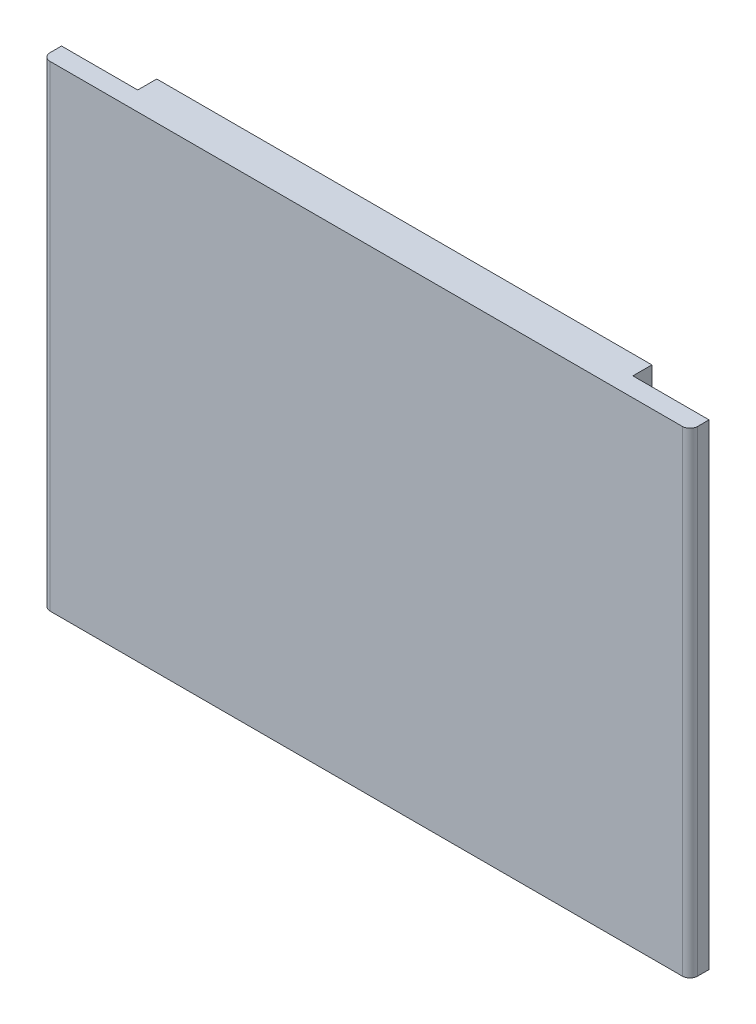
ISO-10303-21;
HEADER;
FILE_DESCRIPTION(('STEP AP214'),'2;1');
FILE_NAME('part.step','',(''),(''),'','','');
FILE_SCHEMA(('AUTOMOTIVE_DESIGN { 1 0 10303 214 1 1 1 1 }'));
ENDSEC;
DATA;
#1=APPLICATION_CONTEXT('core data for automotive mechanical design processes');
#2=APPLICATION_PROTOCOL_DEFINITION('international standard','automotive_design',2000,#1);
#3=PRODUCT_CONTEXT('',#1,'mechanical');
#4=PRODUCT('Part','Part','',(#3));
#5=PRODUCT_RELATED_PRODUCT_CATEGORY('part','',(#4));
#6=PRODUCT_DEFINITION_FORMATION('','',#4);
#7=PRODUCT_DEFINITION_CONTEXT('part definition',#1,'design');
#8=PRODUCT_DEFINITION('design','',#6,#7);
#9=PRODUCT_DEFINITION_SHAPE('','',#8);
#10=(LENGTH_UNIT() NAMED_UNIT(*) SI_UNIT(.MILLI.,.METRE.));
#11=(NAMED_UNIT(*) PLANE_ANGLE_UNIT() SI_UNIT($,.RADIAN.));
#12=(NAMED_UNIT(*) SI_UNIT($,.STERADIAN.) SOLID_ANGLE_UNIT());
#13=UNCERTAINTY_MEASURE_WITH_UNIT(LENGTH_MEASURE(1.E-05),#10,'distance_accuracy_value','');
#14=(GEOMETRIC_REPRESENTATION_CONTEXT(3) GLOBAL_UNCERTAINTY_ASSIGNED_CONTEXT((#13)) GLOBAL_UNIT_ASSIGNED_CONTEXT((#10,
#11,#12)) REPRESENTATION_CONTEXT('',''));
#15=CARTESIAN_POINT('',(0.,0.,0.));
#16=DIRECTION('',(0.,0.,1.));
#17=DIRECTION('',(1.,0.,0.));
#18=AXIS2_PLACEMENT_3D('',#15,#16,#17);
#19=CARTESIAN_POINT('',(0.83,-0.3125,0.58));
#20=DIRECTION('',(0.,-1.,0.));
#21=DIRECTION('',(0.707106781186548,0.,0.707106781186548));
#22=AXIS2_PLACEMENT_3D('',#19,#20,#21);
#23=CYLINDRICAL_SURFACE('',#22,0.02);
#24=CARTESIAN_POINT('',(0.83,-0.625,0.58));
#25=DIRECTION('',(0.,1.,0.));
#26=DIRECTION('',(0.,0.,1.));
#27=AXIS2_PLACEMENT_3D('',#24,#25,#26);
#28=CIRCLE('',#27,0.02);
#29=CARTESIAN_POINT('',(0.83,-0.625,0.6));
#30=VERTEX_POINT('',#29);
#31=CARTESIAN_POINT('',(0.85,-0.625,0.58));
#32=VERTEX_POINT('',#31);
#33=EDGE_CURVE('E11',#30,#32,#28,.T.);
#34=ORIENTED_EDGE('',*,*,#33,.T.);
#35=DIRECTION('',(0.,1.,0.));
#36=VECTOR('',#35,1.);
#37=CARTESIAN_POINT('',(0.85,-0.625,0.58));
#38=LINE('',#37,#36);
#39=CARTESIAN_POINT('',(0.85,0.625,0.58));
#40=VERTEX_POINT('',#39);
#41=EDGE_CURVE('E24',#32,#40,#38,.T.);
#42=ORIENTED_EDGE('',*,*,#41,.T.);
#43=CARTESIAN_POINT('',(0.83,0.625,0.58));
#44=DIRECTION('',(0.,-1.,0.));
#45=DIRECTION('',(1.,0.,0.));
#46=AXIS2_PLACEMENT_3D('',#43,#44,#45);
#47=CIRCLE('',#46,0.02);
#48=CARTESIAN_POINT('',(0.83,0.625,0.6));
#49=VERTEX_POINT('',#48);
#50=EDGE_CURVE('E165',#40,#49,#47,.T.);
#51=ORIENTED_EDGE('',*,*,#50,.T.);
#52=DIRECTION('',(0.,-1.,0.));
#53=VECTOR('',#52,1.);
#54=CARTESIAN_POINT('',(0.83,0.625,0.6));
#55=LINE('',#54,#53);
#56=EDGE_CURVE('E156',#49,#30,#55,.T.);
#57=ORIENTED_EDGE('',*,*,#56,.T.);
#58=EDGE_LOOP('',(#34,#42,#51,#57));
#59=FACE_BOUND('',#58,.T.);
#60=ADVANCED_FACE('F17',(#59),#23,.T.);
#61=CARTESIAN_POINT('',(0.85,-0.625,0.6));
#62=DIRECTION('',(1.,0.,0.));
#63=DIRECTION('',(0.,0.,-1.));
#64=AXIS2_PLACEMENT_3D('',#61,#62,#63);
#65=PLANE('',#64);
#66=ORIENTED_EDGE('',*,*,#41,.F.);
#67=DIRECTION('',(0.,0.,-1.));
#68=VECTOR('',#67,1.);
#69=CARTESIAN_POINT('',(0.850000000000001,-0.625,0.58));
#70=LINE('',#69,#68);
#71=CARTESIAN_POINT('',(0.85,-0.625,0.55));
#72=VERTEX_POINT('',#71);
#73=EDGE_CURVE('E167',#32,#72,#70,.T.);
#74=ORIENTED_EDGE('',*,*,#73,.T.);
#75=DIRECTION('',(0.,1.,0.));
#76=VECTOR('',#75,1.);
#77=CARTESIAN_POINT('',(0.85,-0.625,0.55));
#78=LINE('',#77,#76);
#79=CARTESIAN_POINT('',(0.85,0.625,0.55));
#80=VERTEX_POINT('',#79);
#81=EDGE_CURVE('E158',#72,#80,#78,.T.);
#82=ORIENTED_EDGE('',*,*,#81,.T.);
#83=DIRECTION('',(0.,0.,1.));
#84=VECTOR('',#83,1.);
#85=CARTESIAN_POINT('',(0.85,0.625,0.55));
#86=LINE('',#85,#84);
#87=EDGE_CURVE('E149',#80,#40,#86,.T.);
#88=ORIENTED_EDGE('',*,*,#87,.T.);
#89=EDGE_LOOP('',(#66,#74,#82,#88));
#90=FACE_BOUND('',#89,.T.);
#91=ADVANCED_FACE('F171',(#90),#65,.T.);
#92=CARTESIAN_POINT('',(-1.,-0.625,0.));
#93=DIRECTION('',(0.,-1.,0.));
#94=DIRECTION('',(1.,0.,0.));
#95=AXIS2_PLACEMENT_3D('',#92,#93,#94);
#96=PLANE('',#95);
#97=ORIENTED_EDGE('',*,*,#33,.F.);
#98=DIRECTION('',(1.,0.,0.));
#99=VECTOR('',#98,1.);
#100=CARTESIAN_POINT('',(-0.83,-0.625,0.6));
#101=LINE('',#100,#99);
#102=CARTESIAN_POINT('',(-0.83,-0.625,0.6));
#103=VERTEX_POINT('',#102);
#104=EDGE_CURVE('E160',#103,#30,#101,.T.);
#105=ORIENTED_EDGE('',*,*,#104,.F.);
#106=CARTESIAN_POINT('',(-0.83,-0.625,0.58));
#107=DIRECTION('',(0.,1.,0.));
#108=DIRECTION('',(-1.,0.,0.));
#109=AXIS2_PLACEMENT_3D('',#106,#107,#108);
#110=CIRCLE('',#109,0.02);
#111=CARTESIAN_POINT('',(-0.85,-0.625,0.58));
#112=VERTEX_POINT('',#111);
#113=EDGE_CURVE('E151',#112,#103,#110,.T.);
#114=ORIENTED_EDGE('',*,*,#113,.F.);
#115=DIRECTION('',(0.,0.,1.));
#116=VECTOR('',#115,1.);
#117=CARTESIAN_POINT('',(-0.85,-0.625,0.55));
#118=LINE('',#117,#116);
#119=CARTESIAN_POINT('',(-0.85,-0.625,0.55));
#120=VERTEX_POINT('',#119);
#121=EDGE_CURVE('E141',#120,#112,#118,.T.);
#122=ORIENTED_EDGE('',*,*,#121,.F.);
#123=DIRECTION('',(-1.,0.,0.));
#124=VECTOR('',#123,1.);
#125=CARTESIAN_POINT('',(-0.65,-0.625,0.55));
#126=LINE('',#125,#124);
#127=CARTESIAN_POINT('',(-0.65,-0.625,0.55));
#128=VERTEX_POINT('',#127);
#129=EDGE_CURVE('E131',#128,#120,#126,.T.);
#130=ORIENTED_EDGE('',*,*,#129,.F.);
#131=DIRECTION('',(0.,0.,1.));
#132=VECTOR('',#131,1.);
#133=CARTESIAN_POINT('',(-0.65,-0.625,0.5));
#134=LINE('',#133,#132);
#135=CARTESIAN_POINT('',(-0.65,-0.625,0.5));
#136=VERTEX_POINT('',#135);
#137=EDGE_CURVE('E96',#136,#128,#134,.T.);
#138=ORIENTED_EDGE('',*,*,#137,.F.);
#139=DIRECTION('',(-1.,0.,0.));
#140=VECTOR('',#139,1.);
#141=CARTESIAN_POINT('',(0.65,-0.625,0.5));
#142=LINE('',#141,#140);
#143=CARTESIAN_POINT('',(0.65,-0.625,0.5));
#144=VERTEX_POINT('',#143);
#145=EDGE_CURVE('E88',#144,#136,#142,.T.);
#146=ORIENTED_EDGE('',*,*,#145,.F.);
#147=DIRECTION('',(0.,0.,-1.));
#148=VECTOR('',#147,1.);
#149=CARTESIAN_POINT('',(0.65,-0.625,0.55));
#150=LINE('',#149,#148);
#151=CARTESIAN_POINT('',(0.65,-0.625,0.55));
#152=VERTEX_POINT('',#151);
#153=EDGE_CURVE('E93',#152,#144,#150,.T.);
#154=ORIENTED_EDGE('',*,*,#153,.F.);
#155=DIRECTION('',(-1.,0.,0.));
#156=VECTOR('',#155,1.);
#157=CARTESIAN_POINT('',(0.85,-0.625,0.55));
#158=LINE('',#157,#156);
#159=EDGE_CURVE('E124',#72,#152,#158,.T.);
#160=ORIENTED_EDGE('',*,*,#159,.F.);
#161=ORIENTED_EDGE('',*,*,#73,.F.);
#162=EDGE_LOOP('',(#97,#105,#114,#122,#130,#138,#146,#154,#160,#161));
#163=FACE_BOUND('',#162,.T.);
#164=ADVANCED_FACE('F90',(#163),#96,.T.);
#165=CARTESIAN_POINT('',(-0.83,-0.3125,0.58));
#166=DIRECTION('',(0.,1.,0.));
#167=DIRECTION('',(-0.707106781186548,0.,0.707106781186548));
#168=AXIS2_PLACEMENT_3D('',#165,#166,#167);
#169=CYLINDRICAL_SURFACE('',#168,0.02);
#170=CARTESIAN_POINT('',(-0.83,0.625,0.58));
#171=DIRECTION('',(0.,-1.,0.));
#172=DIRECTION('',(0.,0.,1.));
#173=AXIS2_PLACEMENT_3D('',#170,#171,#172);
#174=CIRCLE('',#173,0.02);
#175=CARTESIAN_POINT('',(-0.83,0.625,0.6));
#176=VERTEX_POINT('',#175);
#177=CARTESIAN_POINT('',(-0.85,0.625,0.58));
#178=VERTEX_POINT('',#177);
#179=EDGE_CURVE('E163',#176,#178,#174,.T.);
#180=ORIENTED_EDGE('',*,*,#179,.T.);
#181=DIRECTION('',(0.,-1.,0.));
#182=VECTOR('',#181,1.);
#183=CARTESIAN_POINT('',(-0.85,0.625,0.58));
#184=LINE('',#183,#182);
#185=EDGE_CURVE('E154',#178,#112,#184,.T.);
#186=ORIENTED_EDGE('',*,*,#185,.T.);
#187=ORIENTED_EDGE('',*,*,#113,.T.);
#188=DIRECTION('',(0.,1.,0.));
#189=VECTOR('',#188,1.);
#190=CARTESIAN_POINT('',(-0.83,-0.625,0.6));
#191=LINE('',#190,#189);
#192=EDGE_CURVE('E134',#103,#176,#191,.T.);
#193=ORIENTED_EDGE('',*,*,#192,.T.);
#194=EDGE_LOOP('',(#180,#186,#187,#193));
#195=FACE_BOUND('',#194,.T.);
#196=ADVANCED_FACE('F187',(#195),#169,.T.);
#197=CARTESIAN_POINT('',(-0.85,-0.625,0.55));
#198=DIRECTION('',(-1.,0.,0.));
#199=DIRECTION('',(0.,0.,1.));
#200=AXIS2_PLACEMENT_3D('',#197,#198,#199);
#201=PLANE('',#200);
#202=ORIENTED_EDGE('',*,*,#185,.F.);
#203=DIRECTION('',(0.,0.,-1.));
#204=VECTOR('',#203,1.);
#205=CARTESIAN_POINT('',(-0.85,0.625,0.58));
#206=LINE('',#205,#204);
#207=CARTESIAN_POINT('',(-0.85,0.625,0.55));
#208=VERTEX_POINT('',#207);
#209=EDGE_CURVE('E144',#178,#208,#206,.T.);
#210=ORIENTED_EDGE('',*,*,#209,.T.);
#211=DIRECTION('',(0.,1.,0.));
#212=VECTOR('',#211,1.);
#213=CARTESIAN_POINT('',(-0.85,-0.625,0.55));
#214=LINE('',#213,#212);
#215=EDGE_CURVE('E136',#120,#208,#214,.T.);
#216=ORIENTED_EDGE('',*,*,#215,.F.);
#217=ORIENTED_EDGE('',*,*,#121,.T.);
#218=EDGE_LOOP('',(#202,#210,#216,#217));
#219=FACE_BOUND('',#218,.T.);
#220=ADVANCED_FACE('F191',(#219),#201,.T.);
#221=CARTESIAN_POINT('',(0.85,-0.625,0.55));
#222=DIRECTION('',(0.,0.,-1.));
#223=DIRECTION('',(-1.,0.,0.));
#224=AXIS2_PLACEMENT_3D('',#221,#222,#223);
#225=PLANE('',#224);
#226=DIRECTION('',(1.,0.,0.));
#227=VECTOR('',#226,1.);
#228=CARTESIAN_POINT('',(0.65,0.625,0.55));
#229=LINE('',#228,#227);
#230=CARTESIAN_POINT('',(0.65,0.625,0.55));
#231=VERTEX_POINT('',#230);
#232=EDGE_CURVE('E146',#231,#80,#229,.T.);
#233=ORIENTED_EDGE('',*,*,#232,.T.);
#234=ORIENTED_EDGE('',*,*,#81,.F.);
#235=ORIENTED_EDGE('',*,*,#159,.T.);
#236=DIRECTION('',(0.,1.,0.));
#237=VECTOR('',#236,1.);
#238=CARTESIAN_POINT('',(0.65,-0.625,0.55));
#239=LINE('',#238,#237);
#240=EDGE_CURVE('E100',#152,#231,#239,.T.);
#241=ORIENTED_EDGE('',*,*,#240,.T.);
#242=EDGE_LOOP('',(#233,#234,#235,#241));
#243=FACE_BOUND('',#242,.T.);
#244=ADVANCED_FACE('F173',(#243),#225,.T.);
#245=CARTESIAN_POINT('',(0.85,-0.625,0.55));
#246=DIRECTION('',(0.,0.,-1.));
#247=DIRECTION('',(-1.,0.,0.));
#248=AXIS2_PLACEMENT_3D('',#245,#246,#247);
#249=PLANE('',#248);
#250=DIRECTION('',(1.,0.,0.));
#251=VECTOR('',#250,1.);
#252=CARTESIAN_POINT('',(-0.85,0.625,0.55));
#253=LINE('',#252,#251);
#254=CARTESIAN_POINT('',(-0.65,0.625,0.55));
#255=VERTEX_POINT('',#254);
#256=EDGE_CURVE('E139',#208,#255,#253,.T.);
#257=ORIENTED_EDGE('',*,*,#256,.T.);
#258=DIRECTION('',(0.,1.,0.));
#259=VECTOR('',#258,1.);
#260=CARTESIAN_POINT('',(-0.65,-0.625,0.55));
#261=LINE('',#260,#259);
#262=EDGE_CURVE('E126',#128,#255,#261,.T.);
#263=ORIENTED_EDGE('',*,*,#262,.F.);
#264=ORIENTED_EDGE('',*,*,#129,.T.);
#265=ORIENTED_EDGE('',*,*,#215,.T.);
#266=EDGE_LOOP('',(#257,#263,#264,#265));
#267=FACE_BOUND('',#266,.T.);
#268=ADVANCED_FACE('F197',(#267),#249,.T.);
#269=CARTESIAN_POINT('',(-0.65,-0.625,0.5));
#270=DIRECTION('',(-1.,0.,0.));
#271=DIRECTION('',(0.,0.,1.));
#272=AXIS2_PLACEMENT_3D('',#269,#270,#271);
#273=PLANE('',#272);
#274=DIRECTION('',(0.,0.,-1.));
#275=VECTOR('',#274,1.);
#276=CARTESIAN_POINT('',(-0.65,0.625,0.55));
#277=LINE('',#276,#275);
#278=CARTESIAN_POINT('',(-0.65,0.625,0.5));
#279=VERTEX_POINT('',#278);
#280=EDGE_CURVE('E129',#255,#279,#277,.T.);
#281=ORIENTED_EDGE('',*,*,#280,.T.);
#282=DIRECTION('',(0.,1.,0.));
#283=VECTOR('',#282,1.);
#284=CARTESIAN_POINT('',(-0.65,-0.625,0.5));
#285=LINE('',#284,#283);
#286=EDGE_CURVE('E120',#136,#279,#285,.T.);
#287=ORIENTED_EDGE('',*,*,#286,.F.);
#288=ORIENTED_EDGE('',*,*,#137,.T.);
#289=ORIENTED_EDGE('',*,*,#262,.T.);
#290=EDGE_LOOP('',(#281,#287,#288,#289));
#291=FACE_BOUND('',#290,.T.);
#292=ADVANCED_FACE('F199',(#291),#273,.T.);
#293=CARTESIAN_POINT('',(0.65,-0.625,0.5));
#294=DIRECTION('',(0.,0.,-1.));
#295=DIRECTION('',(-1.,0.,0.));
#296=AXIS2_PLACEMENT_3D('',#293,#294,#295);
#297=PLANE('',#296);
#298=DIRECTION('',(1.,0.,0.));
#299=VECTOR('',#298,1.);
#300=CARTESIAN_POINT('',(-0.65,0.625,0.5));
#301=LINE('',#300,#299);
#302=CARTESIAN_POINT('',(0.65,0.625,0.5));
#303=VERTEX_POINT('',#302);
#304=EDGE_CURVE('E107',#279,#303,#301,.T.);
#305=ORIENTED_EDGE('',*,*,#304,.T.);
#306=DIRECTION('',(0.,1.,0.));
#307=VECTOR('',#306,1.);
#308=CARTESIAN_POINT('',(0.65,-0.625,0.5));
#309=LINE('',#308,#307);
#310=EDGE_CURVE('E104',#144,#303,#309,.T.);
#311=ORIENTED_EDGE('',*,*,#310,.F.);
#312=ORIENTED_EDGE('',*,*,#145,.T.);
#313=ORIENTED_EDGE('',*,*,#286,.T.);
#314=EDGE_LOOP('',(#305,#311,#312,#313));
#315=FACE_BOUND('',#314,.T.);
#316=ADVANCED_FACE('F105',(#315),#297,.T.);
#317=CARTESIAN_POINT('',(0.65,-0.625,0.55));
#318=DIRECTION('',(1.,0.,0.));
#319=DIRECTION('',(0.,0.,-1.));
#320=AXIS2_PLACEMENT_3D('',#317,#318,#319);
#321=PLANE('',#320);
#322=DIRECTION('',(0.,0.,1.));
#323=VECTOR('',#322,1.);
#324=CARTESIAN_POINT('',(0.65,0.625,0.5));
#325=LINE('',#324,#323);
#326=EDGE_CURVE('E101',#303,#231,#325,.T.);
#327=ORIENTED_EDGE('',*,*,#326,.T.);
#328=ORIENTED_EDGE('',*,*,#240,.F.);
#329=ORIENTED_EDGE('',*,*,#153,.T.);
#330=ORIENTED_EDGE('',*,*,#310,.T.);
#331=EDGE_LOOP('',(#327,#328,#329,#330));
#332=FACE_BOUND('',#331,.T.);
#333=ADVANCED_FACE('F112',(#332),#321,.T.);
#334=CARTESIAN_POINT('',(1.,0.625,0.));
#335=DIRECTION('',(0.,1.,0.));
#336=DIRECTION('',(-1.,0.,0.));
#337=AXIS2_PLACEMENT_3D('',#334,#335,#336);
#338=PLANE('',#337);
#339=ORIENTED_EDGE('',*,*,#50,.F.);
#340=ORIENTED_EDGE('',*,*,#87,.F.);
#341=ORIENTED_EDGE('',*,*,#232,.F.);
#342=ORIENTED_EDGE('',*,*,#326,.F.);
#343=ORIENTED_EDGE('',*,*,#304,.F.);
#344=ORIENTED_EDGE('',*,*,#280,.F.);
#345=ORIENTED_EDGE('',*,*,#256,.F.);
#346=ORIENTED_EDGE('',*,*,#209,.F.);
#347=ORIENTED_EDGE('',*,*,#179,.F.);
#348=DIRECTION('',(-1.,0.,0.));
#349=VECTOR('',#348,1.);
#350=CARTESIAN_POINT('',(0.83,0.625,0.6));
#351=LINE('',#350,#349);
#352=EDGE_CURVE('E113',#49,#176,#351,.T.);
#353=ORIENTED_EDGE('',*,*,#352,.F.);
#354=EDGE_LOOP('',(#339,#340,#341,#342,#343,#344,#345,#346,#347,#353));
#355=FACE_BOUND('',#354,.T.);
#356=ADVANCED_FACE('F178',(#355),#338,.T.);
#357=CARTESIAN_POINT('',(0.,0.,0.6));
#358=DIRECTION('',(0.,0.,1.));
#359=DIRECTION('',(1.,0.,0.));
#360=AXIS2_PLACEMENT_3D('',#357,#358,#359);
#361=PLANE('',#360);
#362=ORIENTED_EDGE('',*,*,#56,.F.);
#363=ORIENTED_EDGE('',*,*,#352,.T.);
#364=ORIENTED_EDGE('',*,*,#192,.F.);
#365=ORIENTED_EDGE('',*,*,#104,.T.);
#366=EDGE_LOOP('',(#362,#363,#364,#365));
#367=FACE_BOUND('',#366,.T.);
#368=ADVANCED_FACE('F183',(#367),#361,.T.);
#369=CLOSED_SHELL('',(#60,#91,#164,#196,#220,#244,#268,#292,#316,#333,#356,#368));
#370=MANIFOLD_SOLID_BREP('B1',#369);
#371=ADVANCED_BREP_SHAPE_REPRESENTATION('',(#18,#370),#14);
#372=SHAPE_DEFINITION_REPRESENTATION(#9,#371);
ENDSEC;
END-ISO-10303-21;
